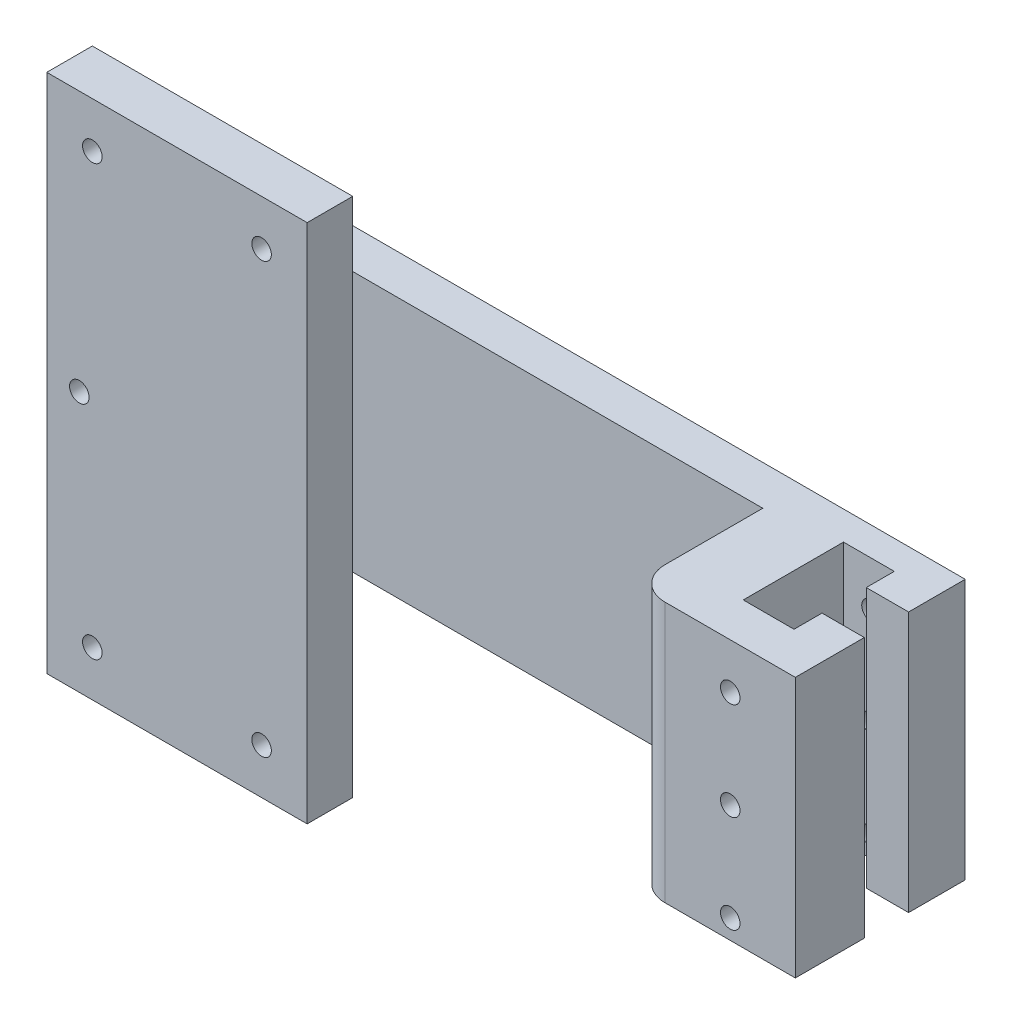
ISO-10303-21;
HEADER;
FILE_DESCRIPTION(('STEP AP214'),'2;1');
FILE_NAME('part.step','',(''),(''),'','','');
FILE_SCHEMA(('AUTOMOTIVE_DESIGN { 1 0 10303 214 1 1 1 1 }'));
ENDSEC;
DATA;
#1=APPLICATION_CONTEXT('core data for automotive mechanical design processes');
#2=APPLICATION_PROTOCOL_DEFINITION('international standard','automotive_design',2000,#1);
#3=PRODUCT_CONTEXT('',#1,'mechanical');
#4=PRODUCT('Part','Part','',(#3));
#5=PRODUCT_RELATED_PRODUCT_CATEGORY('part','',(#4));
#6=PRODUCT_DEFINITION_FORMATION('','',#4);
#7=PRODUCT_DEFINITION_CONTEXT('part definition',#1,'design');
#8=PRODUCT_DEFINITION('design','',#6,#7);
#9=PRODUCT_DEFINITION_SHAPE('','',#8);
#10=(LENGTH_UNIT() NAMED_UNIT(*) SI_UNIT(.MILLI.,.METRE.));
#11=(NAMED_UNIT(*) PLANE_ANGLE_UNIT() SI_UNIT($,.RADIAN.));
#12=(NAMED_UNIT(*) SI_UNIT($,.STERADIAN.) SOLID_ANGLE_UNIT());
#13=UNCERTAINTY_MEASURE_WITH_UNIT(LENGTH_MEASURE(1.E-05),#10,'distance_accuracy_value','');
#14=(GEOMETRIC_REPRESENTATION_CONTEXT(3) GLOBAL_UNCERTAINTY_ASSIGNED_CONTEXT((#13)) GLOBAL_UNIT_ASSIGNED_CONTEXT((#10,
#11,#12)) REPRESENTATION_CONTEXT('',''));
#15=CARTESIAN_POINT('',(0.,0.,0.));
#16=DIRECTION('',(0.,0.,1.));
#17=DIRECTION('',(1.,0.,0.));
#18=AXIS2_PLACEMENT_3D('',#15,#16,#17);
#19=CARTESIAN_POINT('',(40.7664233576642,0.,21.1));
#20=DIRECTION('',(0.,1.,0.));
#21=DIRECTION('',(-1.,0.,0.));
#22=AXIS2_PLACEMENT_3D('',#19,#20,#21);
#23=CYLINDRICAL_SURFACE('',#22,5.);
#24=DIRECTION('',(0.,-1.,0.));
#25=VECTOR('',#24,1.);
#26=CARTESIAN_POINT('',(40.7664233576642,0.,26.1));
#27=LINE('',#26,#25);
#28=CARTESIAN_POINT('',(40.7664233576642,13.3941605839416,26.1));
#29=VERTEX_POINT('',#28);
#30=CARTESIAN_POINT('',(40.7664233576643,-26.6058394160584,26.1));
#31=VERTEX_POINT('',#30);
#32=EDGE_CURVE('E363',#29,#31,#27,.T.);
#33=ORIENTED_EDGE('',*,*,#32,.F.);
#34=CARTESIAN_POINT('',(40.7664233576642,13.3941605839416,21.1));
#35=DIRECTION('',(0.,-1.,0.));
#36=DIRECTION('',(0.,0.,-1.));
#37=AXIS2_PLACEMENT_3D('',#34,#35,#36);
#38=CIRCLE('',#37,5.);
#39=CARTESIAN_POINT('',(35.7664233576642,13.3941605839416,21.1));
#40=VERTEX_POINT('',#39);
#41=EDGE_CURVE('E375',#40,#29,#38,.F.);
#42=ORIENTED_EDGE('',*,*,#41,.F.);
#43=DIRECTION('',(0.,-1.,0.));
#44=VECTOR('',#43,1.);
#45=CARTESIAN_POINT('',(35.7664233576642,0.,21.1));
#46=LINE('',#45,#44);
#47=CARTESIAN_POINT('',(35.7664233576642,-26.6058394160584,21.1));
#48=VERTEX_POINT('',#47);
#49=EDGE_CURVE('E372',#48,#40,#46,.F.);
#50=ORIENTED_EDGE('',*,*,#49,.F.);
#51=CARTESIAN_POINT('',(40.7664233576642,-26.6058394160584,21.1));
#52=DIRECTION('',(0.,1.,0.));
#53=DIRECTION('',(0.,0.,1.));
#54=AXIS2_PLACEMENT_3D('',#51,#52,#53);
#55=CIRCLE('',#54,5.);
#56=EDGE_CURVE('E39',#31,#48,#55,.F.);
#57=ORIENTED_EDGE('',*,*,#56,.F.);
#58=EDGE_LOOP('',(#33,#42,#50,#57));
#59=FACE_BOUND('',#58,.T.);
#60=ADVANCED_FACE('F32',(#59),#23,.T.);
#61=CARTESIAN_POINT('',(0.,0.,26.1));
#62=DIRECTION('',(0.,0.,1.));
#63=DIRECTION('',(1.,0.,0.));
#64=AXIS2_PLACEMENT_3D('',#61,#62,#63);
#65=PLANE('',#64);
#66=CARTESIAN_POINT('',(50.7664233576642,-23.6058394160584,26.1));
#67=DIRECTION('',(0.,0.,1.));
#68=DIRECTION('',(1.,0.,0.));
#69=AXIS2_PLACEMENT_3D('',#66,#67,#68);
#70=CIRCLE('',#69,1.5);
#71=CARTESIAN_POINT('',(52.2664233576642,-23.6058394160584,26.1));
#72=VERTEX_POINT('',#71);
#73=EDGE_CURVE('E226',#72,#72,#70,.T.);
#74=ORIENTED_EDGE('',*,*,#73,.F.);
#75=EDGE_LOOP('',(#74));
#76=FACE_BOUND('',#75,.T.);
#77=CARTESIAN_POINT('',(50.7664233576642,-8.60583941605839,26.1));
#78=DIRECTION('',(0.,0.,1.));
#79=DIRECTION('',(1.,0.,0.));
#80=AXIS2_PLACEMENT_3D('',#77,#78,#79);
#81=CIRCLE('',#80,1.5);
#82=CARTESIAN_POINT('',(52.2664233576642,-8.60583941605839,26.1));
#83=VERTEX_POINT('',#82);
#84=EDGE_CURVE('E236',#83,#83,#81,.T.);
#85=ORIENTED_EDGE('',*,*,#84,.F.);
#86=EDGE_LOOP('',(#85));
#87=FACE_BOUND('',#86,.T.);
#88=CARTESIAN_POINT('',(50.7664233576642,6.39416058394161,26.1));
#89=DIRECTION('',(0.,0.,1.));
#90=DIRECTION('',(1.,0.,0.));
#91=AXIS2_PLACEMENT_3D('',#88,#89,#90);
#92=CIRCLE('',#91,1.5);
#93=CARTESIAN_POINT('',(52.2664233576642,6.39416058394161,26.1));
#94=VERTEX_POINT('',#93);
#95=EDGE_CURVE('E246',#94,#94,#92,.T.);
#96=ORIENTED_EDGE('',*,*,#95,.F.);
#97=EDGE_LOOP('',(#96));
#98=FACE_BOUND('',#97,.T.);
#99=DIRECTION('',(-1.,0.,0.));
#100=VECTOR('',#99,1.);
#101=CARTESIAN_POINT('',(-49.2335766423358,13.3941605839416,26.1));
#102=LINE('',#101,#100);
#103=CARTESIAN_POINT('',(60.7664233576642,13.3941605839416,26.1));
#104=VERTEX_POINT('',#103);
#105=EDGE_CURVE('E338',#104,#29,#102,.T.);
#106=ORIENTED_EDGE('',*,*,#105,.T.);
#107=ORIENTED_EDGE('',*,*,#32,.T.);
#108=DIRECTION('',(1.,0.,0.));
#109=VECTOR('',#108,1.);
#110=CARTESIAN_POINT('',(-49.2335766423358,-26.6058394160584,26.1));
#111=LINE('',#110,#109);
#112=CARTESIAN_POINT('',(60.7664233576642,-26.6058394160584,26.1));
#113=VERTEX_POINT('',#112);
#114=EDGE_CURVE('E333',#31,#113,#111,.T.);
#115=ORIENTED_EDGE('',*,*,#114,.T.);
#116=DIRECTION('',(0.,1.,0.));
#117=VECTOR('',#116,1.);
#118=CARTESIAN_POINT('',(60.7664233576642,13.3941605839416,26.1));
#119=LINE('',#118,#117);
#120=EDGE_CURVE('E335',#113,#104,#119,.T.);
#121=ORIENTED_EDGE('',*,*,#120,.T.);
#122=EDGE_LOOP('',(#106,#107,#115,#121));
#123=FACE_BOUND('',#122,.T.);
#124=ADVANCED_FACE('F384',(#76,#87,#98,#123),#65,.T.);
#125=CARTESIAN_POINT('',(60.7664233576642,13.3941605839416,26.1));
#126=DIRECTION('',(-1.,0.,0.));
#127=DIRECTION('',(0.,0.,1.));
#128=AXIS2_PLACEMENT_3D('',#125,#126,#127);
#129=PLANE('',#128);
#130=DIRECTION('',(0.,1.,0.));
#131=VECTOR('',#130,1.);
#132=CARTESIAN_POINT('',(60.7664233576642,-26.6058394160584,15.5));
#133=LINE('',#132,#131);
#134=CARTESIAN_POINT('',(60.7664233576642,-26.6058394160584,15.5));
#135=VERTEX_POINT('',#134);
#136=CARTESIAN_POINT('',(60.7664233576642,13.3941605839416,15.5));
#137=VERTEX_POINT('',#136);
#138=EDGE_CURVE('E318',#135,#137,#133,.T.);
#139=ORIENTED_EDGE('',*,*,#138,.T.);
#140=DIRECTION('',(0.,0.,-1.));
#141=VECTOR('',#140,1.);
#142=CARTESIAN_POINT('',(60.7664233576642,13.3941605839416,26.1));
#143=LINE('',#142,#141);
#144=EDGE_CURVE('E354',#104,#137,#143,.T.);
#145=ORIENTED_EDGE('',*,*,#144,.F.);
#146=ORIENTED_EDGE('',*,*,#120,.F.);
#147=DIRECTION('',(0.,0.,-1.));
#148=VECTOR('',#147,1.);
#149=CARTESIAN_POINT('',(60.7664233576642,-26.6058394160584,26.1));
#150=LINE('',#149,#148);
#151=EDGE_CURVE('E358',#113,#135,#150,.T.);
#152=ORIENTED_EDGE('',*,*,#151,.T.);
#153=EDGE_LOOP('',(#139,#145,#146,#152));
#154=FACE_BOUND('',#153,.T.);
#155=ADVANCED_FACE('F389',(#154),#129,.F.);
#156=CARTESIAN_POINT('',(-49.2335766423358,13.3941605839416,26.1));
#157=DIRECTION('',(1.,0.,0.));
#158=DIRECTION('',(0.,0.,-1.));
#159=AXIS2_PLACEMENT_3D('',#156,#157,#158);
#160=PLANE('',#159);
#161=DIRECTION('',(0.,0.,-1.));
#162=VECTOR('',#161,1.);
#163=CARTESIAN_POINT('',(-49.2335766423358,-26.6058394160584,26.1));
#164=LINE('',#163,#162);
#165=CARTESIAN_POINT('',(-49.2335766423358,-26.6058394160584,16.1));
#166=VERTEX_POINT('',#165);
#167=CARTESIAN_POINT('',(-49.2335766423358,-26.6058394160584,0.));
#168=VERTEX_POINT('',#167);
#169=EDGE_CURVE('E361',#166,#168,#164,.T.);
#170=ORIENTED_EDGE('',*,*,#169,.F.);
#171=DIRECTION('',(0.,1.,0.));
#172=VECTOR('',#171,1.);
#173=CARTESIAN_POINT('',(-49.2335766423358,13.3941605839416,16.1));
#174=LINE('',#173,#172);
#175=CARTESIAN_POINT('',(-49.2335766423358,13.3941605839416,16.1));
#176=VERTEX_POINT('',#175);
#177=EDGE_CURVE('E223',#166,#176,#174,.T.);
#178=ORIENTED_EDGE('',*,*,#177,.T.);
#179=DIRECTION('',(0.,0.,-1.));
#180=VECTOR('',#179,1.);
#181=CARTESIAN_POINT('',(-49.2335766423358,13.3941605839416,26.1));
#182=LINE('',#181,#180);
#183=CARTESIAN_POINT('',(-49.2335766423358,13.3941605839416,0.));
#184=VERTEX_POINT('',#183);
#185=EDGE_CURVE('E341',#176,#184,#182,.T.);
#186=ORIENTED_EDGE('',*,*,#185,.T.);
#187=DIRECTION('',(0.,-1.,0.));
#188=VECTOR('',#187,1.);
#189=CARTESIAN_POINT('',(-49.2335766423358,13.3941605839416,0.));
#190=LINE('',#189,#188);
#191=EDGE_CURVE('E317',#184,#168,#190,.T.);
#192=ORIENTED_EDGE('',*,*,#191,.T.);
#193=EDGE_LOOP('',(#170,#178,#186,#192));
#194=FACE_BOUND('',#193,.T.);
#195=ADVANCED_FACE('F434',(#194),#160,.F.);
#196=CARTESIAN_POINT('',(-49.2335766423358,-26.6058394160584,26.1));
#197=DIRECTION('',(0.,1.,0.));
#198=DIRECTION('',(0.,0.,1.));
#199=AXIS2_PLACEMENT_3D('',#196,#197,#198);
#200=PLANE('',#199);
#201=DIRECTION('',(0.,0.,1.));
#202=VECTOR('',#201,1.);
#203=CARTESIAN_POINT('',(-29.2335766423358,-26.6058394160584,6.1));
#204=LINE('',#203,#202);
#205=CARTESIAN_POINT('',(-29.2335766423358,-26.6058394160584,6.1));
#206=VERTEX_POINT('',#205);
#207=CARTESIAN_POINT('',(-29.2335766423358,-26.6058394160584,16.1));
#208=VERTEX_POINT('',#207);
#209=EDGE_CURVE('E273',#206,#208,#204,.T.);
#210=ORIENTED_EDGE('',*,*,#209,.T.);
#211=DIRECTION('',(-1.,0.,0.));
#212=VECTOR('',#211,1.);
#213=CARTESIAN_POINT('',(-49.2335766423358,-26.6058394160584,16.1));
#214=LINE('',#213,#212);
#215=EDGE_CURVE('E46',#208,#166,#214,.T.);
#216=ORIENTED_EDGE('',*,*,#215,.T.);
#217=ORIENTED_EDGE('',*,*,#169,.T.);
#218=DIRECTION('',(1.,0.,0.));
#219=VECTOR('',#218,1.);
#220=CARTESIAN_POINT('',(-49.2335766423358,-26.6058394160584,0.));
#221=LINE('',#220,#219);
#222=CARTESIAN_POINT('',(60.7664233576642,-26.6058394160584,0.));
#223=VERTEX_POINT('',#222);
#224=EDGE_CURVE('E344',#168,#223,#221,.T.);
#225=ORIENTED_EDGE('',*,*,#224,.T.);
#226=CARTESIAN_POINT('',(60.7664233576642,-26.6058394160584,8.7));
#227=VERTEX_POINT('',#226);
#228=EDGE_CURVE('E357',#227,#223,#150,.T.);
#229=ORIENTED_EDGE('',*,*,#228,.F.);
#230=DIRECTION('',(-1.,0.,0.));
#231=VECTOR('',#230,1.);
#232=CARTESIAN_POINT('',(0.,-26.6058394160584,8.7));
#233=LINE('',#232,#231);
#234=CARTESIAN_POINT('',(54.2664233576642,-26.6058394160584,8.7));
#235=VERTEX_POINT('',#234);
#236=EDGE_CURVE('E281',#227,#235,#233,.T.);
#237=ORIENTED_EDGE('',*,*,#236,.T.);
#238=DIRECTION('',(0.,0.,-1.));
#239=VECTOR('',#238,1.);
#240=CARTESIAN_POINT('',(54.2664233576642,-26.6058394160584,0.));
#241=LINE('',#240,#239);
#242=CARTESIAN_POINT('',(54.2664233576642,-26.6058394160584,4.4));
#243=VERTEX_POINT('',#242);
#244=EDGE_CURVE('E284',#235,#243,#241,.T.);
#245=ORIENTED_EDGE('',*,*,#244,.T.);
#246=DIRECTION('',(1.,0.,0.));
#247=VECTOR('',#246,1.);
#248=CARTESIAN_POINT('',(0.,-26.6058394160584,4.4));
#249=LINE('',#248,#247);
#250=CARTESIAN_POINT('',(46.4664233576642,-26.6058394160584,4.4));
#251=VERTEX_POINT('',#250);
#252=EDGE_CURVE('E288',#251,#243,#249,.T.);
#253=ORIENTED_EDGE('',*,*,#252,.F.);
#254=DIRECTION('',(0.,0.,-1.));
#255=VECTOR('',#254,1.);
#256=CARTESIAN_POINT('',(46.4664233576642,-26.6058394160584,0.));
#257=LINE('',#256,#255);
#258=CARTESIAN_POINT('',(46.4664233576642,-26.6058394160584,19.8));
#259=VERTEX_POINT('',#258);
#260=EDGE_CURVE('E291',#259,#251,#257,.T.);
#261=ORIENTED_EDGE('',*,*,#260,.F.);
#262=DIRECTION('',(1.,0.,0.));
#263=VECTOR('',#262,1.);
#264=CARTESIAN_POINT('',(0.,-26.6058394160584,19.8));
#265=LINE('',#264,#263);
#266=CARTESIAN_POINT('',(54.2664233576642,-26.6058394160584,19.8));
#267=VERTEX_POINT('',#266);
#268=EDGE_CURVE('E293',#259,#267,#265,.T.);
#269=ORIENTED_EDGE('',*,*,#268,.T.);
#270=CARTESIAN_POINT('',(54.2664233576642,-26.6058394160584,15.5));
#271=VERTEX_POINT('',#270);
#272=EDGE_CURVE('E289',#267,#271,#241,.T.);
#273=ORIENTED_EDGE('',*,*,#272,.T.);
#274=DIRECTION('',(-1.,0.,0.));
#275=VECTOR('',#274,1.);
#276=CARTESIAN_POINT('',(0.,-26.6058394160584,15.5));
#277=LINE('',#276,#275);
#278=EDGE_CURVE('E296',#135,#271,#277,.T.);
#279=ORIENTED_EDGE('',*,*,#278,.F.);
#280=ORIENTED_EDGE('',*,*,#151,.F.);
#281=ORIENTED_EDGE('',*,*,#114,.F.);
#282=ORIENTED_EDGE('',*,*,#56,.T.);
#283=DIRECTION('',(0.,0.,1.));
#284=VECTOR('',#283,1.);
#285=CARTESIAN_POINT('',(35.7664233576642,-26.6058394160584,6.1));
#286=LINE('',#285,#284);
#287=CARTESIAN_POINT('',(35.7664233576642,-26.6058394160584,6.1));
#288=VERTEX_POINT('',#287);
#289=EDGE_CURVE('E269',#288,#48,#286,.T.);
#290=ORIENTED_EDGE('',*,*,#289,.F.);
#291=DIRECTION('',(1.,0.,0.));
#292=VECTOR('',#291,1.);
#293=CARTESIAN_POINT('',(35.7664233576642,-26.6058394160584,6.1));
#294=LINE('',#293,#292);
#295=EDGE_CURVE('E265',#206,#288,#294,.T.);
#296=ORIENTED_EDGE('',*,*,#295,.F.);
#297=EDGE_LOOP('',(#210,#216,#217,#225,#229,#237,#245,#253,#261,#269,#273,#279,#280,#281,#282,
#290,#296));
#298=FACE_BOUND('',#297,.T.);
#299=ADVANCED_FACE('F435',(#298),#200,.F.);
#300=CARTESIAN_POINT('',(60.7664233576642,13.3941605839416,8.7));
#301=VERTEX_POINT('',#300);
#302=CARTESIAN_POINT('',(60.7664233576642,13.3941605839416,0.));
#303=VERTEX_POINT('',#302);
#304=EDGE_CURVE('E353',#301,#303,#143,.T.);
#305=ORIENTED_EDGE('',*,*,#304,.F.);
#306=DIRECTION('',(0.,1.,0.));
#307=VECTOR('',#306,1.);
#308=CARTESIAN_POINT('',(60.7664233576642,-26.6058394160584,8.7));
#309=LINE('',#308,#307);
#310=EDGE_CURVE('E315',#227,#301,#309,.T.);
#311=ORIENTED_EDGE('',*,*,#310,.F.);
#312=ORIENTED_EDGE('',*,*,#228,.T.);
#313=DIRECTION('',(0.,1.,0.));
#314=VECTOR('',#313,1.);
#315=CARTESIAN_POINT('',(60.7664233576642,13.3941605839416,0.));
#316=LINE('',#315,#314);
#317=EDGE_CURVE('E347',#223,#303,#316,.T.);
#318=ORIENTED_EDGE('',*,*,#317,.T.);
#319=EDGE_LOOP('',(#305,#311,#312,#318));
#320=FACE_BOUND('',#319,.T.);
#321=ADVANCED_FACE('F423',(#320),#129,.F.);
#322=CARTESIAN_POINT('',(-49.2335766423358,13.3941605839416,26.1));
#323=DIRECTION('',(0.,-1.,0.));
#324=DIRECTION('',(0.,0.,-1.));
#325=AXIS2_PLACEMENT_3D('',#322,#323,#324);
#326=PLANE('',#325);
#327=ORIENTED_EDGE('',*,*,#185,.F.);
#328=DIRECTION('',(1.,0.,0.));
#329=VECTOR('',#328,1.);
#330=CARTESIAN_POINT('',(-49.2335766423358,13.3941605839416,16.1));
#331=LINE('',#330,#329);
#332=CARTESIAN_POINT('',(-29.2335766423358,13.3941605839416,16.1));
#333=VERTEX_POINT('',#332);
#334=EDGE_CURVE('E216',#176,#333,#331,.T.);
#335=ORIENTED_EDGE('',*,*,#334,.T.);
#336=DIRECTION('',(0.,0.,1.));
#337=VECTOR('',#336,1.);
#338=CARTESIAN_POINT('',(-29.2335766423358,13.3941605839416,6.1));
#339=LINE('',#338,#337);
#340=CARTESIAN_POINT('',(-29.2335766423358,13.3941605839416,6.1));
#341=VERTEX_POINT('',#340);
#342=EDGE_CURVE('E276',#341,#333,#339,.T.);
#343=ORIENTED_EDGE('',*,*,#342,.F.);
#344=DIRECTION('',(-1.,0.,0.));
#345=VECTOR('',#344,1.);
#346=CARTESIAN_POINT('',(35.7664233576642,13.3941605839416,6.1));
#347=LINE('',#346,#345);
#348=CARTESIAN_POINT('',(35.7664233576642,13.3941605839416,6.1));
#349=VERTEX_POINT('',#348);
#350=EDGE_CURVE('E259',#349,#341,#347,.T.);
#351=ORIENTED_EDGE('',*,*,#350,.F.);
#352=DIRECTION('',(0.,0.,1.));
#353=VECTOR('',#352,1.);
#354=CARTESIAN_POINT('',(35.7664233576642,13.3941605839416,6.1));
#355=LINE('',#354,#353);
#356=EDGE_CURVE('E268',#349,#40,#355,.T.);
#357=ORIENTED_EDGE('',*,*,#356,.T.);
#358=ORIENTED_EDGE('',*,*,#41,.T.);
#359=ORIENTED_EDGE('',*,*,#105,.F.);
#360=ORIENTED_EDGE('',*,*,#144,.T.);
#361=DIRECTION('',(-1.,0.,0.));
#362=VECTOR('',#361,1.);
#363=CARTESIAN_POINT('',(0.,13.3941605839416,15.5));
#364=LINE('',#363,#362);
#365=CARTESIAN_POINT('',(54.2664233576642,13.3941605839416,15.5));
#366=VERTEX_POINT('',#365);
#367=EDGE_CURVE('E285',#137,#366,#364,.T.);
#368=ORIENTED_EDGE('',*,*,#367,.T.);
#369=DIRECTION('',(0.,0.,-1.));
#370=VECTOR('',#369,1.);
#371=CARTESIAN_POINT('',(54.2664233576642,13.3941605839416,0.));
#372=LINE('',#371,#370);
#373=CARTESIAN_POINT('',(54.2664233576642,13.3941605839416,19.8));
#374=VERTEX_POINT('',#373);
#375=EDGE_CURVE('E304',#374,#366,#372,.T.);
#376=ORIENTED_EDGE('',*,*,#375,.F.);
#377=DIRECTION('',(1.,0.,0.));
#378=VECTOR('',#377,1.);
#379=CARTESIAN_POINT('',(0.,13.3941605839416,19.8));
#380=LINE('',#379,#378);
#381=CARTESIAN_POINT('',(46.4664233576642,13.3941605839416,19.8));
#382=VERTEX_POINT('',#381);
#383=EDGE_CURVE('E310',#382,#374,#380,.T.);
#384=ORIENTED_EDGE('',*,*,#383,.F.);
#385=DIRECTION('',(0.,0.,-1.));
#386=VECTOR('',#385,1.);
#387=CARTESIAN_POINT('',(46.4664233576642,13.3941605839416,0.));
#388=LINE('',#387,#386);
#389=CARTESIAN_POINT('',(46.4664233576642,13.3941605839416,4.4));
#390=VERTEX_POINT('',#389);
#391=EDGE_CURVE('E307',#382,#390,#388,.T.);
#392=ORIENTED_EDGE('',*,*,#391,.T.);
#393=DIRECTION('',(1.,0.,0.));
#394=VECTOR('',#393,1.);
#395=CARTESIAN_POINT('',(0.,13.3941605839416,4.4));
#396=LINE('',#395,#394);
#397=CARTESIAN_POINT('',(54.2664233576642,13.3941605839416,4.4));
#398=VERTEX_POINT('',#397);
#399=EDGE_CURVE('E303',#390,#398,#396,.T.);
#400=ORIENTED_EDGE('',*,*,#399,.T.);
#401=CARTESIAN_POINT('',(54.2664233576642,13.3941605839416,8.7));
#402=VERTEX_POINT('',#401);
#403=EDGE_CURVE('E300',#402,#398,#372,.T.);
#404=ORIENTED_EDGE('',*,*,#403,.F.);
#405=DIRECTION('',(-1.,0.,0.));
#406=VECTOR('',#405,1.);
#407=CARTESIAN_POINT('',(0.,13.3941605839416,8.7));
#408=LINE('',#407,#406);
#409=EDGE_CURVE('E272',#301,#402,#408,.T.);
#410=ORIENTED_EDGE('',*,*,#409,.F.);
#411=ORIENTED_EDGE('',*,*,#304,.T.);
#412=DIRECTION('',(-1.,0.,0.));
#413=VECTOR('',#412,1.);
#414=CARTESIAN_POINT('',(-49.2335766423358,13.3941605839416,0.));
#415=LINE('',#414,#413);
#416=EDGE_CURVE('E336',#303,#184,#415,.T.);
#417=ORIENTED_EDGE('',*,*,#416,.T.);
#418=EDGE_LOOP('',(#327,#335,#343,#351,#357,#358,#359,#360,#368,#376,#384,#392,#400,#404,#410,
#411,#417));
#419=FACE_BOUND('',#418,.T.);
#420=ADVANCED_FACE('F380',(#419),#326,.F.);
#421=CARTESIAN_POINT('',(0.,0.,0.));
#422=DIRECTION('',(0.,0.,1.));
#423=DIRECTION('',(1.,0.,0.));
#424=AXIS2_PLACEMENT_3D('',#421,#422,#423);
#425=PLANE('',#424);
#426=CARTESIAN_POINT('',(50.7664233576642,-23.6058394160584,0.));
#427=DIRECTION('',(0.,0.,1.));
#428=DIRECTION('',(1.,0.,0.));
#429=AXIS2_PLACEMENT_3D('',#426,#427,#428);
#430=CIRCLE('',#429,1.5);
#431=CARTESIAN_POINT('',(52.2664233576642,-23.6058394160584,0.));
#432=VERTEX_POINT('',#431);
#433=EDGE_CURVE('E227',#432,#432,#430,.T.);
#434=ORIENTED_EDGE('',*,*,#433,.T.);
#435=EDGE_LOOP('',(#434));
#436=FACE_BOUND('',#435,.T.);
#437=CARTESIAN_POINT('',(50.7664233576642,-8.60583941605839,0.));
#438=DIRECTION('',(0.,0.,1.));
#439=DIRECTION('',(1.,0.,0.));
#440=AXIS2_PLACEMENT_3D('',#437,#438,#439);
#441=CIRCLE('',#440,1.5);
#442=CARTESIAN_POINT('',(52.2664233576642,-8.60583941605839,0.));
#443=VERTEX_POINT('',#442);
#444=EDGE_CURVE('E237',#443,#443,#441,.T.);
#445=ORIENTED_EDGE('',*,*,#444,.T.);
#446=EDGE_LOOP('',(#445));
#447=FACE_BOUND('',#446,.T.);
#448=CARTESIAN_POINT('',(50.7664233576642,6.39416058394161,0.));
#449=DIRECTION('',(0.,0.,1.));
#450=DIRECTION('',(1.,0.,0.));
#451=AXIS2_PLACEMENT_3D('',#448,#449,#450);
#452=CIRCLE('',#451,1.5);
#453=CARTESIAN_POINT('',(52.2664233576642,6.39416058394161,0.));
#454=VERTEX_POINT('',#453);
#455=EDGE_CURVE('E247',#454,#454,#452,.T.);
#456=ORIENTED_EDGE('',*,*,#455,.T.);
#457=EDGE_LOOP('',(#456));
#458=FACE_BOUND('',#457,.T.);
#459=ORIENTED_EDGE('',*,*,#191,.F.);
#460=ORIENTED_EDGE('',*,*,#416,.F.);
#461=ORIENTED_EDGE('',*,*,#317,.F.);
#462=ORIENTED_EDGE('',*,*,#224,.F.);
#463=EDGE_LOOP('',(#459,#460,#461,#462));
#464=FACE_BOUND('',#463,.T.);
#465=ADVANCED_FACE('F430',(#436,#447,#458,#464),#425,.F.);
#466=CARTESIAN_POINT('',(0.,-26.6058394160584,8.7));
#467=DIRECTION('',(0.,0.,-1.));
#468=DIRECTION('',(-1.,0.,0.));
#469=AXIS2_PLACEMENT_3D('',#466,#467,#468);
#470=PLANE('',#469);
#471=ORIENTED_EDGE('',*,*,#409,.T.);
#472=DIRECTION('',(0.,1.,0.));
#473=VECTOR('',#472,1.);
#474=CARTESIAN_POINT('',(54.2664233576642,-26.6058394160584,8.7));
#475=LINE('',#474,#473);
#476=EDGE_CURVE('E298',#235,#402,#475,.T.);
#477=ORIENTED_EDGE('',*,*,#476,.F.);
#478=ORIENTED_EDGE('',*,*,#236,.F.);
#479=ORIENTED_EDGE('',*,*,#310,.T.);
#480=EDGE_LOOP('',(#471,#477,#478,#479));
#481=FACE_BOUND('',#480,.T.);
#482=ADVANCED_FACE('F466',(#481),#470,.F.);
#483=CARTESIAN_POINT('',(0.,-26.6058394160584,15.5));
#484=DIRECTION('',(0.,0.,-1.));
#485=DIRECTION('',(-1.,0.,0.));
#486=AXIS2_PLACEMENT_3D('',#483,#484,#485);
#487=PLANE('',#486);
#488=ORIENTED_EDGE('',*,*,#367,.F.);
#489=ORIENTED_EDGE('',*,*,#138,.F.);
#490=ORIENTED_EDGE('',*,*,#278,.T.);
#491=DIRECTION('',(0.,1.,0.));
#492=VECTOR('',#491,1.);
#493=CARTESIAN_POINT('',(54.2664233576642,-26.6058394160584,15.5));
#494=LINE('',#493,#492);
#495=EDGE_CURVE('E321',#271,#366,#494,.T.);
#496=ORIENTED_EDGE('',*,*,#495,.T.);
#497=EDGE_LOOP('',(#488,#489,#490,#496));
#498=FACE_BOUND('',#497,.T.);
#499=ADVANCED_FACE('F394',(#498),#487,.T.);
#500=CARTESIAN_POINT('',(54.2664233576642,-26.6058394160584,0.));
#501=DIRECTION('',(1.,0.,0.));
#502=DIRECTION('',(0.,0.,-1.));
#503=AXIS2_PLACEMENT_3D('',#500,#501,#502);
#504=PLANE('',#503);
#505=ORIENTED_EDGE('',*,*,#375,.T.);
#506=ORIENTED_EDGE('',*,*,#495,.F.);
#507=ORIENTED_EDGE('',*,*,#272,.F.);
#508=DIRECTION('',(0.,1.,0.));
#509=VECTOR('',#508,1.);
#510=CARTESIAN_POINT('',(54.2664233576642,-26.6058394160584,19.8));
#511=LINE('',#510,#509);
#512=EDGE_CURVE('E323',#267,#374,#511,.T.);
#513=ORIENTED_EDGE('',*,*,#512,.T.);
#514=EDGE_LOOP('',(#505,#506,#507,#513));
#515=FACE_BOUND('',#514,.T.);
#516=ADVANCED_FACE('F400',(#515),#504,.F.);
#517=CARTESIAN_POINT('',(0.,-26.6058394160584,19.8));
#518=DIRECTION('',(0.,0.,1.));
#519=DIRECTION('',(1.,0.,0.));
#520=AXIS2_PLACEMENT_3D('',#517,#518,#519);
#521=PLANE('',#520);
#522=CARTESIAN_POINT('',(50.7664233576642,-23.6058394160584,19.8));
#523=DIRECTION('',(0.,0.,1.));
#524=DIRECTION('',(1.,0.,0.));
#525=AXIS2_PLACEMENT_3D('',#522,#523,#524);
#526=CIRCLE('',#525,1.5);
#527=CARTESIAN_POINT('',(52.2664233576642,-23.6058394160584,19.8));
#528=VERTEX_POINT('',#527);
#529=EDGE_CURVE('E233',#528,#528,#526,.T.);
#530=ORIENTED_EDGE('',*,*,#529,.T.);
#531=EDGE_LOOP('',(#530));
#532=FACE_BOUND('',#531,.T.);
#533=CARTESIAN_POINT('',(50.7664233576642,-8.60583941605839,19.8));
#534=DIRECTION('',(0.,0.,1.));
#535=DIRECTION('',(1.,0.,0.));
#536=AXIS2_PLACEMENT_3D('',#533,#534,#535);
#537=CIRCLE('',#536,1.5);
#538=CARTESIAN_POINT('',(52.2664233576642,-8.60583941605839,19.8));
#539=VERTEX_POINT('',#538);
#540=EDGE_CURVE('E243',#539,#539,#537,.T.);
#541=ORIENTED_EDGE('',*,*,#540,.T.);
#542=EDGE_LOOP('',(#541));
#543=FACE_BOUND('',#542,.T.);
#544=CARTESIAN_POINT('',(50.7664233576642,6.39416058394161,19.8));
#545=DIRECTION('',(0.,0.,1.));
#546=DIRECTION('',(1.,0.,0.));
#547=AXIS2_PLACEMENT_3D('',#544,#545,#546);
#548=CIRCLE('',#547,1.5);
#549=CARTESIAN_POINT('',(52.2664233576642,6.39416058394161,19.8));
#550=VERTEX_POINT('',#549);
#551=EDGE_CURVE('E253',#550,#550,#548,.T.);
#552=ORIENTED_EDGE('',*,*,#551,.T.);
#553=EDGE_LOOP('',(#552));
#554=FACE_BOUND('',#553,.T.);
#555=ORIENTED_EDGE('',*,*,#383,.T.);
#556=ORIENTED_EDGE('',*,*,#512,.F.);
#557=ORIENTED_EDGE('',*,*,#268,.F.);
#558=DIRECTION('',(0.,1.,0.));
#559=VECTOR('',#558,1.);
#560=CARTESIAN_POINT('',(46.4664233576642,-26.6058394160584,19.8));
#561=LINE('',#560,#559);
#562=EDGE_CURVE('E325',#259,#382,#561,.T.);
#563=ORIENTED_EDGE('',*,*,#562,.T.);
#564=EDGE_LOOP('',(#555,#556,#557,#563));
#565=FACE_BOUND('',#564,.T.);
#566=ADVANCED_FACE('F403',(#532,#543,#554,#565),#521,.F.);
#567=CARTESIAN_POINT('',(46.4664233576642,-26.6058394160584,0.));
#568=DIRECTION('',(1.,0.,0.));
#569=DIRECTION('',(0.,0.,-1.));
#570=AXIS2_PLACEMENT_3D('',#567,#568,#569);
#571=PLANE('',#570);
#572=ORIENTED_EDGE('',*,*,#391,.F.);
#573=ORIENTED_EDGE('',*,*,#562,.F.);
#574=ORIENTED_EDGE('',*,*,#260,.T.);
#575=DIRECTION('',(0.,1.,0.));
#576=VECTOR('',#575,1.);
#577=CARTESIAN_POINT('',(46.4664233576642,-26.6058394160584,4.4));
#578=LINE('',#577,#576);
#579=EDGE_CURVE('E327',#251,#390,#578,.T.);
#580=ORIENTED_EDGE('',*,*,#579,.T.);
#581=EDGE_LOOP('',(#572,#573,#574,#580));
#582=FACE_BOUND('',#581,.T.);
#583=ADVANCED_FACE('F408',(#582),#571,.T.);
#584=CARTESIAN_POINT('',(0.,-26.6058394160584,4.4));
#585=DIRECTION('',(0.,0.,1.));
#586=DIRECTION('',(1.,0.,0.));
#587=AXIS2_PLACEMENT_3D('',#584,#585,#586);
#588=PLANE('',#587);
#589=CARTESIAN_POINT('',(50.7664233576642,-23.6058394160584,4.4));
#590=DIRECTION('',(0.,0.,1.));
#591=DIRECTION('',(1.,0.,0.));
#592=AXIS2_PLACEMENT_3D('',#589,#590,#591);
#593=CIRCLE('',#592,1.5);
#594=CARTESIAN_POINT('',(52.2664233576642,-23.6058394160584,4.4));
#595=VERTEX_POINT('',#594);
#596=EDGE_CURVE('E230',#595,#595,#593,.T.);
#597=ORIENTED_EDGE('',*,*,#596,.F.);
#598=EDGE_LOOP('',(#597));
#599=FACE_BOUND('',#598,.T.);
#600=CARTESIAN_POINT('',(50.7664233576642,-8.60583941605839,4.4));
#601=DIRECTION('',(0.,0.,1.));
#602=DIRECTION('',(1.,0.,0.));
#603=AXIS2_PLACEMENT_3D('',#600,#601,#602);
#604=CIRCLE('',#603,1.5);
#605=CARTESIAN_POINT('',(52.2664233576642,-8.60583941605839,4.4));
#606=VERTEX_POINT('',#605);
#607=EDGE_CURVE('E240',#606,#606,#604,.T.);
#608=ORIENTED_EDGE('',*,*,#607,.F.);
#609=EDGE_LOOP('',(#608));
#610=FACE_BOUND('',#609,.T.);
#611=CARTESIAN_POINT('',(50.7664233576642,6.39416058394161,4.4));
#612=DIRECTION('',(0.,0.,1.));
#613=DIRECTION('',(1.,0.,0.));
#614=AXIS2_PLACEMENT_3D('',#611,#612,#613);
#615=CIRCLE('',#614,1.5);
#616=CARTESIAN_POINT('',(52.2664233576642,6.39416058394161,4.4));
#617=VERTEX_POINT('',#616);
#618=EDGE_CURVE('E250',#617,#617,#615,.T.);
#619=ORIENTED_EDGE('',*,*,#618,.F.);
#620=EDGE_LOOP('',(#619));
#621=FACE_BOUND('',#620,.T.);
#622=ORIENTED_EDGE('',*,*,#399,.F.);
#623=ORIENTED_EDGE('',*,*,#579,.F.);
#624=ORIENTED_EDGE('',*,*,#252,.T.);
#625=DIRECTION('',(0.,1.,0.));
#626=VECTOR('',#625,1.);
#627=CARTESIAN_POINT('',(54.2664233576642,-26.6058394160584,4.4));
#628=LINE('',#627,#626);
#629=EDGE_CURVE('E329',#243,#398,#628,.T.);
#630=ORIENTED_EDGE('',*,*,#629,.T.);
#631=EDGE_LOOP('',(#622,#623,#624,#630));
#632=FACE_BOUND('',#631,.T.);
#633=ADVANCED_FACE('F413',(#599,#610,#621,#632),#588,.T.);
#634=ORIENTED_EDGE('',*,*,#403,.T.);
#635=ORIENTED_EDGE('',*,*,#629,.F.);
#636=ORIENTED_EDGE('',*,*,#244,.F.);
#637=ORIENTED_EDGE('',*,*,#476,.T.);
#638=EDGE_LOOP('',(#634,#635,#636,#637));
#639=FACE_BOUND('',#638,.T.);
#640=ADVANCED_FACE('F417',(#639),#504,.F.);
#641=CARTESIAN_POINT('',(35.7664233576642,13.3941605839416,6.1));
#642=DIRECTION('',(1.,0.,0.));
#643=DIRECTION('',(0.,1.,0.));
#644=AXIS2_PLACEMENT_3D('',#641,#642,#643);
#645=PLANE('',#644);
#646=ORIENTED_EDGE('',*,*,#289,.T.);
#647=ORIENTED_EDGE('',*,*,#49,.T.);
#648=ORIENTED_EDGE('',*,*,#356,.F.);
#649=DIRECTION('',(0.,1.,0.));
#650=VECTOR('',#649,1.);
#651=CARTESIAN_POINT('',(35.7664233576642,13.3941605839416,6.1));
#652=LINE('',#651,#650);
#653=EDGE_CURVE('E256',#288,#349,#652,.T.);
#654=ORIENTED_EDGE('',*,*,#653,.F.);
#655=EDGE_LOOP('',(#646,#647,#648,#654));
#656=FACE_BOUND('',#655,.T.);
#657=ADVANCED_FACE('F442',(#656),#645,.F.);
#658=CARTESIAN_POINT('',(-29.2335766423358,13.3941605839416,6.1));
#659=DIRECTION('',(-1.,0.,0.));
#660=DIRECTION('',(0.,0.,1.));
#661=AXIS2_PLACEMENT_3D('',#658,#659,#660);
#662=PLANE('',#661);
#663=ORIENTED_EDGE('',*,*,#342,.T.);
#664=DIRECTION('',(0.,-1.,0.));
#665=VECTOR('',#664,1.);
#666=CARTESIAN_POINT('',(-29.2335766423358,13.3941605839416,16.1));
#667=LINE('',#666,#665);
#668=EDGE_CURVE('E11',#333,#208,#667,.T.);
#669=ORIENTED_EDGE('',*,*,#668,.T.);
#670=ORIENTED_EDGE('',*,*,#209,.F.);
#671=DIRECTION('',(0.,-1.,0.));
#672=VECTOR('',#671,1.);
#673=CARTESIAN_POINT('',(-29.2335766423358,13.3941605839416,6.1));
#674=LINE('',#673,#672);
#675=EDGE_CURVE('E262',#341,#206,#674,.T.);
#676=ORIENTED_EDGE('',*,*,#675,.F.);
#677=EDGE_LOOP('',(#663,#669,#670,#676));
#678=FACE_BOUND('',#677,.T.);
#679=ADVANCED_FACE('F438',(#678),#662,.F.);
#680=CARTESIAN_POINT('',(0.,0.,6.1));
#681=DIRECTION('',(0.,0.,-1.));
#682=DIRECTION('',(-1.,0.,0.));
#683=AXIS2_PLACEMENT_3D('',#680,#681,#682);
#684=PLANE('',#683);
#685=ORIENTED_EDGE('',*,*,#653,.T.);
#686=ORIENTED_EDGE('',*,*,#350,.T.);
#687=ORIENTED_EDGE('',*,*,#675,.T.);
#688=ORIENTED_EDGE('',*,*,#295,.T.);
#689=EDGE_LOOP('',(#685,#686,#687,#688));
#690=FACE_BOUND('',#689,.T.);
#691=ADVANCED_FACE('F440',(#690),#684,.F.);
#692=CARTESIAN_POINT('',(50.7664233576642,6.39416058394161,0.));
#693=DIRECTION('',(0.,0.,1.));
#694=DIRECTION('',(1.,0.,0.));
#695=AXIS2_PLACEMENT_3D('',#692,#693,#694);
#696=CYLINDRICAL_SURFACE('',#695,1.5);
#697=ORIENTED_EDGE('',*,*,#618,.T.);
#698=EDGE_LOOP('',(#697));
#699=FACE_BOUND('',#698,.T.);
#700=ORIENTED_EDGE('',*,*,#455,.F.);
#701=EDGE_LOOP('',(#700));
#702=FACE_BOUND('',#701,.T.);
#703=ADVANCED_FACE('F546',(#699,#702),#696,.F.);
#704=ORIENTED_EDGE('',*,*,#95,.T.);
#705=EDGE_LOOP('',(#704));
#706=FACE_BOUND('',#705,.T.);
#707=ORIENTED_EDGE('',*,*,#551,.F.);
#708=EDGE_LOOP('',(#707));
#709=FACE_BOUND('',#708,.T.);
#710=ADVANCED_FACE('F557',(#706,#709),#696,.F.);
#711=CARTESIAN_POINT('',(50.7664233576642,-8.60583941605839,0.));
#712=DIRECTION('',(0.,0.,1.));
#713=DIRECTION('',(1.,0.,0.));
#714=AXIS2_PLACEMENT_3D('',#711,#712,#713);
#715=CYLINDRICAL_SURFACE('',#714,1.5);
#716=ORIENTED_EDGE('',*,*,#607,.T.);
#717=EDGE_LOOP('',(#716));
#718=FACE_BOUND('',#717,.T.);
#719=ORIENTED_EDGE('',*,*,#444,.F.);
#720=EDGE_LOOP('',(#719));
#721=FACE_BOUND('',#720,.T.);
#722=ADVANCED_FACE('F564',(#718,#721),#715,.F.);
#723=ORIENTED_EDGE('',*,*,#84,.T.);
#724=EDGE_LOOP('',(#723));
#725=FACE_BOUND('',#724,.T.);
#726=ORIENTED_EDGE('',*,*,#540,.F.);
#727=EDGE_LOOP('',(#726));
#728=FACE_BOUND('',#727,.T.);
#729=ADVANCED_FACE('F571',(#725,#728),#715,.F.);
#730=CARTESIAN_POINT('',(50.7664233576642,-23.6058394160584,0.));
#731=DIRECTION('',(0.,0.,1.));
#732=DIRECTION('',(1.,0.,0.));
#733=AXIS2_PLACEMENT_3D('',#730,#731,#732);
#734=CYLINDRICAL_SURFACE('',#733,1.5);
#735=ORIENTED_EDGE('',*,*,#596,.T.);
#736=EDGE_LOOP('',(#735));
#737=FACE_BOUND('',#736,.T.);
#738=ORIENTED_EDGE('',*,*,#433,.F.);
#739=EDGE_LOOP('',(#738));
#740=FACE_BOUND('',#739,.T.);
#741=ADVANCED_FACE('F579',(#737,#740),#734,.F.);
#742=ORIENTED_EDGE('',*,*,#73,.T.);
#743=EDGE_LOOP('',(#742));
#744=FACE_BOUND('',#743,.T.);
#745=ORIENTED_EDGE('',*,*,#529,.F.);
#746=EDGE_LOOP('',(#745));
#747=FACE_BOUND('',#746,.T.);
#748=ADVANCED_FACE('F586',(#744,#747),#734,.F.);
#749=CARTESIAN_POINT('',(0.,0.,16.1));
#750=DIRECTION('',(0.,0.,-1.));
#751=DIRECTION('',(-1.,0.,0.));
#752=AXIS2_PLACEMENT_3D('',#749,#750,#751);
#753=PLANE('',#752);
#754=CARTESIAN_POINT('',(-24.2335766423358,-39.6058394160584,16.1));
#755=DIRECTION('',(0.,0.,1.));
#756=DIRECTION('',(1.,0.,0.));
#757=AXIS2_PLACEMENT_3D('',#754,#755,#756);
#758=CIRCLE('',#757,1.5);
#759=CARTESIAN_POINT('',(-22.7335766423358,-39.6058394160584,16.1));
#760=VERTEX_POINT('',#759);
#761=EDGE_CURVE('E733',#760,#760,#758,.T.);
#762=ORIENTED_EDGE('',*,*,#761,.T.);
#763=EDGE_LOOP('',(#762));
#764=FACE_BOUND('',#763,.T.);
#765=CARTESIAN_POINT('',(-50.2335766423358,-39.6058394160584,16.1));
#766=DIRECTION('',(0.,0.,1.));
#767=DIRECTION('',(1.,0.,0.));
#768=AXIS2_PLACEMENT_3D('',#765,#766,#767);
#769=CIRCLE('',#768,1.5);
#770=CARTESIAN_POINT('',(-48.7335766423358,-39.6058394160584,16.1));
#771=VERTEX_POINT('',#770);
#772=EDGE_CURVE('E741',#771,#771,#769,.T.);
#773=ORIENTED_EDGE('',*,*,#772,.T.);
#774=EDGE_LOOP('',(#773));
#775=FACE_BOUND('',#774,.T.);
#776=CARTESIAN_POINT('',(-52.2335766423358,-6.60583941605839,16.1));
#777=DIRECTION('',(0.,0.,1.));
#778=DIRECTION('',(1.,0.,0.));
#779=AXIS2_PLACEMENT_3D('',#776,#777,#778);
#780=CIRCLE('',#779,1.5);
#781=CARTESIAN_POINT('',(-50.7335766423358,-6.60583941605839,16.1));
#782=VERTEX_POINT('',#781);
#783=EDGE_CURVE('E747',#782,#782,#780,.T.);
#784=ORIENTED_EDGE('',*,*,#783,.T.);
#785=EDGE_LOOP('',(#784));
#786=FACE_BOUND('',#785,.T.);
#787=CARTESIAN_POINT('',(-50.2335766423358,26.3941605839416,16.1));
#788=DIRECTION('',(0.,0.,1.));
#789=DIRECTION('',(1.,0.,0.));
#790=AXIS2_PLACEMENT_3D('',#787,#788,#789);
#791=CIRCLE('',#790,1.5);
#792=CARTESIAN_POINT('',(-48.7335766423358,26.3941605839416,16.1));
#793=VERTEX_POINT('',#792);
#794=EDGE_CURVE('E753',#793,#793,#791,.T.);
#795=ORIENTED_EDGE('',*,*,#794,.T.);
#796=EDGE_LOOP('',(#795));
#797=FACE_BOUND('',#796,.T.);
#798=CARTESIAN_POINT('',(-24.2335766423358,26.3941605839416,16.1));
#799=DIRECTION('',(0.,0.,1.));
#800=DIRECTION('',(1.,0.,0.));
#801=AXIS2_PLACEMENT_3D('',#798,#799,#800);
#802=CIRCLE('',#801,1.5);
#803=CARTESIAN_POINT('',(-22.7335766423358,26.3941605839416,16.1));
#804=VERTEX_POINT('',#803);
#805=EDGE_CURVE('E211',#804,#804,#802,.T.);
#806=ORIENTED_EDGE('',*,*,#805,.T.);
#807=EDGE_LOOP('',(#806));
#808=FACE_BOUND('',#807,.T.);
#809=DIRECTION('',(0.,1.,0.));
#810=VECTOR('',#809,1.);
#811=CARTESIAN_POINT('',(-17.2335766423358,33.3941605839416,16.1));
#812=LINE('',#811,#810);
#813=CARTESIAN_POINT('',(-17.2335766423358,-46.6058394160584,16.1));
#814=VERTEX_POINT('',#813);
#815=CARTESIAN_POINT('',(-17.2335766423358,33.3941605839416,16.1));
#816=VERTEX_POINT('',#815);
#817=EDGE_CURVE('E191',#814,#816,#812,.T.);
#818=ORIENTED_EDGE('',*,*,#817,.F.);
#819=DIRECTION('',(1.,0.,0.));
#820=VECTOR('',#819,1.);
#821=CARTESIAN_POINT('',(-17.2335766423358,-46.6058394160584,16.1));
#822=LINE('',#821,#820);
#823=CARTESIAN_POINT('',(-57.2335766423358,-46.6058394160584,16.1));
#824=VERTEX_POINT('',#823);
#825=EDGE_CURVE('E184',#824,#814,#822,.T.);
#826=ORIENTED_EDGE('',*,*,#825,.F.);
#827=DIRECTION('',(0.,-1.,0.));
#828=VECTOR('',#827,1.);
#829=CARTESIAN_POINT('',(-57.2335766423358,33.3941605839416,16.1));
#830=LINE('',#829,#828);
#831=CARTESIAN_POINT('',(-57.2335766423358,33.3941605839416,16.1));
#832=VERTEX_POINT('',#831);
#833=EDGE_CURVE('E194',#832,#824,#830,.T.);
#834=ORIENTED_EDGE('',*,*,#833,.F.);
#835=DIRECTION('',(-1.,0.,0.));
#836=VECTOR('',#835,1.);
#837=CARTESIAN_POINT('',(-17.2335766423358,33.3941605839416,16.1));
#838=LINE('',#837,#836);
#839=EDGE_CURVE('E176',#816,#832,#838,.T.);
#840=ORIENTED_EDGE('',*,*,#839,.F.);
#841=EDGE_LOOP('',(#818,#826,#834,#840));
#842=FACE_BOUND('',#841,.T.);
#843=ORIENTED_EDGE('',*,*,#177,.F.);
#844=ORIENTED_EDGE('',*,*,#215,.F.);
#845=ORIENTED_EDGE('',*,*,#668,.F.);
#846=ORIENTED_EDGE('',*,*,#334,.F.);
#847=EDGE_LOOP('',(#843,#844,#845,#846));
#848=FACE_BOUND('',#847,.T.);
#849=ADVANCED_FACE('F189',(#764,#775,#786,#797,#808,#842,#848),#753,.T.);
#850=CARTESIAN_POINT('',(-17.2335766423358,33.3941605839416,16.1));
#851=DIRECTION('',(1.,0.,0.));
#852=DIRECTION('',(0.,1.,0.));
#853=AXIS2_PLACEMENT_3D('',#850,#851,#852);
#854=PLANE('',#853);
#855=DIRECTION('',(0.,1.,0.));
#856=VECTOR('',#855,1.);
#857=CARTESIAN_POINT('',(-17.2335766423358,33.3941605839416,23.1));
#858=LINE('',#857,#856);
#859=CARTESIAN_POINT('',(-17.2335766423358,-46.6058394160584,23.1));
#860=VERTEX_POINT('',#859);
#861=CARTESIAN_POINT('',(-17.2335766423358,33.3941605839416,23.1));
#862=VERTEX_POINT('',#861);
#863=EDGE_CURVE('E209',#860,#862,#858,.T.);
#864=ORIENTED_EDGE('',*,*,#863,.F.);
#865=DIRECTION('',(0.,0.,1.));
#866=VECTOR('',#865,1.);
#867=CARTESIAN_POINT('',(-17.2335766423358,-46.6058394160584,16.1));
#868=LINE('',#867,#866);
#869=EDGE_CURVE('E197',#814,#860,#868,.T.);
#870=ORIENTED_EDGE('',*,*,#869,.F.);
#871=ORIENTED_EDGE('',*,*,#817,.T.);
#872=DIRECTION('',(0.,0.,1.));
#873=VECTOR('',#872,1.);
#874=CARTESIAN_POINT('',(-17.2335766423358,33.3941605839416,16.1));
#875=LINE('',#874,#873);
#876=EDGE_CURVE('E173',#816,#862,#875,.T.);
#877=ORIENTED_EDGE('',*,*,#876,.T.);
#878=EDGE_LOOP('',(#864,#870,#871,#877));
#879=FACE_BOUND('',#878,.T.);
#880=ADVANCED_FACE('F196',(#879),#854,.T.);
#881=CARTESIAN_POINT('',(-17.2335766423358,-46.6058394160584,16.1));
#882=DIRECTION('',(0.,-1.,0.));
#883=DIRECTION('',(0.,0.,-1.));
#884=AXIS2_PLACEMENT_3D('',#881,#882,#883);
#885=PLANE('',#884);
#886=DIRECTION('',(1.,0.,0.));
#887=VECTOR('',#886,1.);
#888=CARTESIAN_POINT('',(-17.2335766423358,-46.6058394160584,23.1));
#889=LINE('',#888,#887);
#890=CARTESIAN_POINT('',(-57.2335766423358,-46.6058394160584,23.1));
#891=VERTEX_POINT('',#890);
#892=EDGE_CURVE('E198',#891,#860,#889,.T.);
#893=ORIENTED_EDGE('',*,*,#892,.F.);
#894=DIRECTION('',(0.,0.,1.));
#895=VECTOR('',#894,1.);
#896=CARTESIAN_POINT('',(-57.2335766423358,-46.6058394160584,16.1));
#897=LINE('',#896,#895);
#898=EDGE_CURVE('E217',#824,#891,#897,.T.);
#899=ORIENTED_EDGE('',*,*,#898,.F.);
#900=ORIENTED_EDGE('',*,*,#825,.T.);
#901=ORIENTED_EDGE('',*,*,#869,.T.);
#902=EDGE_LOOP('',(#893,#899,#900,#901));
#903=FACE_BOUND('',#902,.T.);
#904=ADVANCED_FACE('F609',(#903),#885,.T.);
#905=CARTESIAN_POINT('',(-57.2335766423358,33.3941605839416,16.1));
#906=DIRECTION('',(-1.,0.,0.));
#907=DIRECTION('',(0.,-1.,0.));
#908=AXIS2_PLACEMENT_3D('',#905,#906,#907);
#909=PLANE('',#908);
#910=DIRECTION('',(0.,-1.,0.));
#911=VECTOR('',#910,1.);
#912=CARTESIAN_POINT('',(-57.2335766423358,33.3941605839416,23.1));
#913=LINE('',#912,#911);
#914=CARTESIAN_POINT('',(-57.2335766423358,33.3941605839416,23.1));
#915=VERTEX_POINT('',#914);
#916=EDGE_CURVE('E201',#915,#891,#913,.T.);
#917=ORIENTED_EDGE('',*,*,#916,.F.);
#918=DIRECTION('',(0.,0.,1.));
#919=VECTOR('',#918,1.);
#920=CARTESIAN_POINT('',(-57.2335766423358,33.3941605839416,16.1));
#921=LINE('',#920,#919);
#922=EDGE_CURVE('E183',#832,#915,#921,.T.);
#923=ORIENTED_EDGE('',*,*,#922,.F.);
#924=ORIENTED_EDGE('',*,*,#833,.T.);
#925=ORIENTED_EDGE('',*,*,#898,.T.);
#926=EDGE_LOOP('',(#917,#923,#924,#925));
#927=FACE_BOUND('',#926,.T.);
#928=ADVANCED_FACE('F616',(#927),#909,.T.);
#929=CARTESIAN_POINT('',(-17.2335766423358,33.3941605839416,16.1));
#930=DIRECTION('',(0.,1.,0.));
#931=DIRECTION('',(-1.,0.,0.));
#932=AXIS2_PLACEMENT_3D('',#929,#930,#931);
#933=PLANE('',#932);
#934=DIRECTION('',(-1.,0.,0.));
#935=VECTOR('',#934,1.);
#936=CARTESIAN_POINT('',(-17.2335766423358,33.3941605839416,23.1));
#937=LINE('',#936,#935);
#938=EDGE_CURVE('E178',#862,#915,#937,.T.);
#939=ORIENTED_EDGE('',*,*,#938,.F.);
#940=ORIENTED_EDGE('',*,*,#876,.F.);
#941=ORIENTED_EDGE('',*,*,#839,.T.);
#942=ORIENTED_EDGE('',*,*,#922,.T.);
#943=EDGE_LOOP('',(#939,#940,#941,#942));
#944=FACE_BOUND('',#943,.T.);
#945=ADVANCED_FACE('F175',(#944),#933,.T.);
#946=CARTESIAN_POINT('',(0.,0.,23.1));
#947=DIRECTION('',(0.,0.,-1.));
#948=DIRECTION('',(-1.,0.,0.));
#949=AXIS2_PLACEMENT_3D('',#946,#947,#948);
#950=PLANE('',#949);
#951=CARTESIAN_POINT('',(-24.2335766423358,-39.6058394160584,23.1));
#952=DIRECTION('',(0.,0.,1.));
#953=DIRECTION('',(1.,0.,0.));
#954=AXIS2_PLACEMENT_3D('',#951,#952,#953);
#955=CIRCLE('',#954,1.5);
#956=CARTESIAN_POINT('',(-22.7335766423358,-39.6058394160584,23.1));
#957=VERTEX_POINT('',#956);
#958=EDGE_CURVE('E736',#957,#957,#955,.T.);
#959=ORIENTED_EDGE('',*,*,#958,.F.);
#960=EDGE_LOOP('',(#959));
#961=FACE_BOUND('',#960,.T.);
#962=CARTESIAN_POINT('',(-50.2335766423358,-39.6058394160584,23.1));
#963=DIRECTION('',(0.,0.,1.));
#964=DIRECTION('',(1.,0.,0.));
#965=AXIS2_PLACEMENT_3D('',#962,#963,#964);
#966=CIRCLE('',#965,1.5);
#967=CARTESIAN_POINT('',(-48.7335766423358,-39.6058394160584,23.1));
#968=VERTEX_POINT('',#967);
#969=EDGE_CURVE('E738',#968,#968,#966,.T.);
#970=ORIENTED_EDGE('',*,*,#969,.F.);
#971=EDGE_LOOP('',(#970));
#972=FACE_BOUND('',#971,.T.);
#973=CARTESIAN_POINT('',(-52.2335766423358,-6.60583941605839,23.1));
#974=DIRECTION('',(0.,0.,1.));
#975=DIRECTION('',(1.,0.,0.));
#976=AXIS2_PLACEMENT_3D('',#973,#974,#975);
#977=CIRCLE('',#976,1.5);
#978=CARTESIAN_POINT('',(-50.7335766423358,-6.60583941605839,23.1));
#979=VERTEX_POINT('',#978);
#980=EDGE_CURVE('E744',#979,#979,#977,.T.);
#981=ORIENTED_EDGE('',*,*,#980,.F.);
#982=EDGE_LOOP('',(#981));
#983=FACE_BOUND('',#982,.T.);
#984=CARTESIAN_POINT('',(-50.2335766423358,26.3941605839416,23.1));
#985=DIRECTION('',(0.,0.,1.));
#986=DIRECTION('',(1.,0.,0.));
#987=AXIS2_PLACEMENT_3D('',#984,#985,#986);
#988=CIRCLE('',#987,1.5);
#989=CARTESIAN_POINT('',(-48.7335766423358,26.3941605839416,23.1));
#990=VERTEX_POINT('',#989);
#991=EDGE_CURVE('E750',#990,#990,#988,.T.);
#992=ORIENTED_EDGE('',*,*,#991,.F.);
#993=EDGE_LOOP('',(#992));
#994=FACE_BOUND('',#993,.T.);
#995=CARTESIAN_POINT('',(-24.2335766423358,26.3941605839416,23.1));
#996=DIRECTION('',(0.,0.,1.));
#997=DIRECTION('',(1.,0.,0.));
#998=AXIS2_PLACEMENT_3D('',#995,#996,#997);
#999=CIRCLE('',#998,1.5);
#1000=CARTESIAN_POINT('',(-22.7335766423358,26.3941605839416,23.1));
#1001=VERTEX_POINT('',#1000);
#1002=EDGE_CURVE('E204',#1001,#1001,#999,.T.);
#1003=ORIENTED_EDGE('',*,*,#1002,.F.);
#1004=EDGE_LOOP('',(#1003));
#1005=FACE_BOUND('',#1004,.T.);
#1006=ORIENTED_EDGE('',*,*,#863,.T.);
#1007=ORIENTED_EDGE('',*,*,#938,.T.);
#1008=ORIENTED_EDGE('',*,*,#916,.T.);
#1009=ORIENTED_EDGE('',*,*,#892,.T.);
#1010=EDGE_LOOP('',(#1006,#1007,#1008,#1009));
#1011=FACE_BOUND('',#1010,.T.);
#1012=ADVANCED_FACE('F630',(#961,#972,#983,#994,#1005,#1011),#950,.F.);
#1013=CARTESIAN_POINT('',(-24.2335766423358,26.3941605839416,16.1));
#1014=DIRECTION('',(0.,0.,1.));
#1015=DIRECTION('',(1.,0.,0.));
#1016=AXIS2_PLACEMENT_3D('',#1013,#1014,#1015);
#1017=CYLINDRICAL_SURFACE('',#1016,1.5);
#1018=ORIENTED_EDGE('',*,*,#805,.F.);
#1019=EDGE_LOOP('',(#1018));
#1020=FACE_BOUND('',#1019,.T.);
#1021=ORIENTED_EDGE('',*,*,#1002,.T.);
#1022=EDGE_LOOP('',(#1021));
#1023=FACE_BOUND('',#1022,.T.);
#1024=ADVANCED_FACE('F636',(#1020,#1023),#1017,.F.);
#1025=CARTESIAN_POINT('',(-50.2335766423358,26.3941605839416,16.1));
#1026=DIRECTION('',(0.,0.,1.));
#1027=DIRECTION('',(1.,0.,0.));
#1028=AXIS2_PLACEMENT_3D('',#1025,#1026,#1027);
#1029=CYLINDRICAL_SURFACE('',#1028,1.5);
#1030=ORIENTED_EDGE('',*,*,#794,.F.);
#1031=EDGE_LOOP('',(#1030));
#1032=FACE_BOUND('',#1031,.T.);
#1033=ORIENTED_EDGE('',*,*,#991,.T.);
#1034=EDGE_LOOP('',(#1033));
#1035=FACE_BOUND('',#1034,.T.);
#1036=ADVANCED_FACE('F644',(#1032,#1035),#1029,.F.);
#1037=CARTESIAN_POINT('',(-52.2335766423358,-6.60583941605839,16.1));
#1038=DIRECTION('',(0.,0.,1.));
#1039=DIRECTION('',(1.,0.,0.));
#1040=AXIS2_PLACEMENT_3D('',#1037,#1038,#1039);
#1041=CYLINDRICAL_SURFACE('',#1040,1.5);
#1042=ORIENTED_EDGE('',*,*,#783,.F.);
#1043=EDGE_LOOP('',(#1042));
#1044=FACE_BOUND('',#1043,.T.);
#1045=ORIENTED_EDGE('',*,*,#980,.T.);
#1046=EDGE_LOOP('',(#1045));
#1047=FACE_BOUND('',#1046,.T.);
#1048=ADVANCED_FACE('F652',(#1044,#1047),#1041,.F.);
#1049=CARTESIAN_POINT('',(-50.2335766423358,-39.6058394160584,16.1));
#1050=DIRECTION('',(0.,0.,1.));
#1051=DIRECTION('',(1.,0.,0.));
#1052=AXIS2_PLACEMENT_3D('',#1049,#1050,#1051);
#1053=CYLINDRICAL_SURFACE('',#1052,1.5);
#1054=ORIENTED_EDGE('',*,*,#772,.F.);
#1055=EDGE_LOOP('',(#1054));
#1056=FACE_BOUND('',#1055,.T.);
#1057=ORIENTED_EDGE('',*,*,#969,.T.);
#1058=EDGE_LOOP('',(#1057));
#1059=FACE_BOUND('',#1058,.T.);
#1060=ADVANCED_FACE('F660',(#1056,#1059),#1053,.F.);
#1061=CARTESIAN_POINT('',(-24.2335766423358,-39.6058394160584,16.1));
#1062=DIRECTION('',(0.,0.,1.));
#1063=DIRECTION('',(1.,0.,0.));
#1064=AXIS2_PLACEMENT_3D('',#1061,#1062,#1063);
#1065=CYLINDRICAL_SURFACE('',#1064,1.5);
#1066=ORIENTED_EDGE('',*,*,#761,.F.);
#1067=EDGE_LOOP('',(#1066));
#1068=FACE_BOUND('',#1067,.T.);
#1069=ORIENTED_EDGE('',*,*,#958,.T.);
#1070=EDGE_LOOP('',(#1069));
#1071=FACE_BOUND('',#1070,.T.);
#1072=ADVANCED_FACE('F668',(#1068,#1071),#1065,.F.);
#1073=CLOSED_SHELL('',(#60,#124,#155,#195,#299,#321,#420,#465,#482,#499,#516,#566,#583,#633,
#640,#657,#679,#691,#703,#710,#722,#729,#741,#748,#849,#880,#904,#928,#945,#1012,#1024,#1036,
#1048,#1060,#1072));
#1074=MANIFOLD_SOLID_BREP('B2',#1073);
#1075=ADVANCED_BREP_SHAPE_REPRESENTATION('',(#18,#1074),#14);
#1076=SHAPE_DEFINITION_REPRESENTATION(#9,#1075);
ENDSEC;
END-ISO-10303-21;
